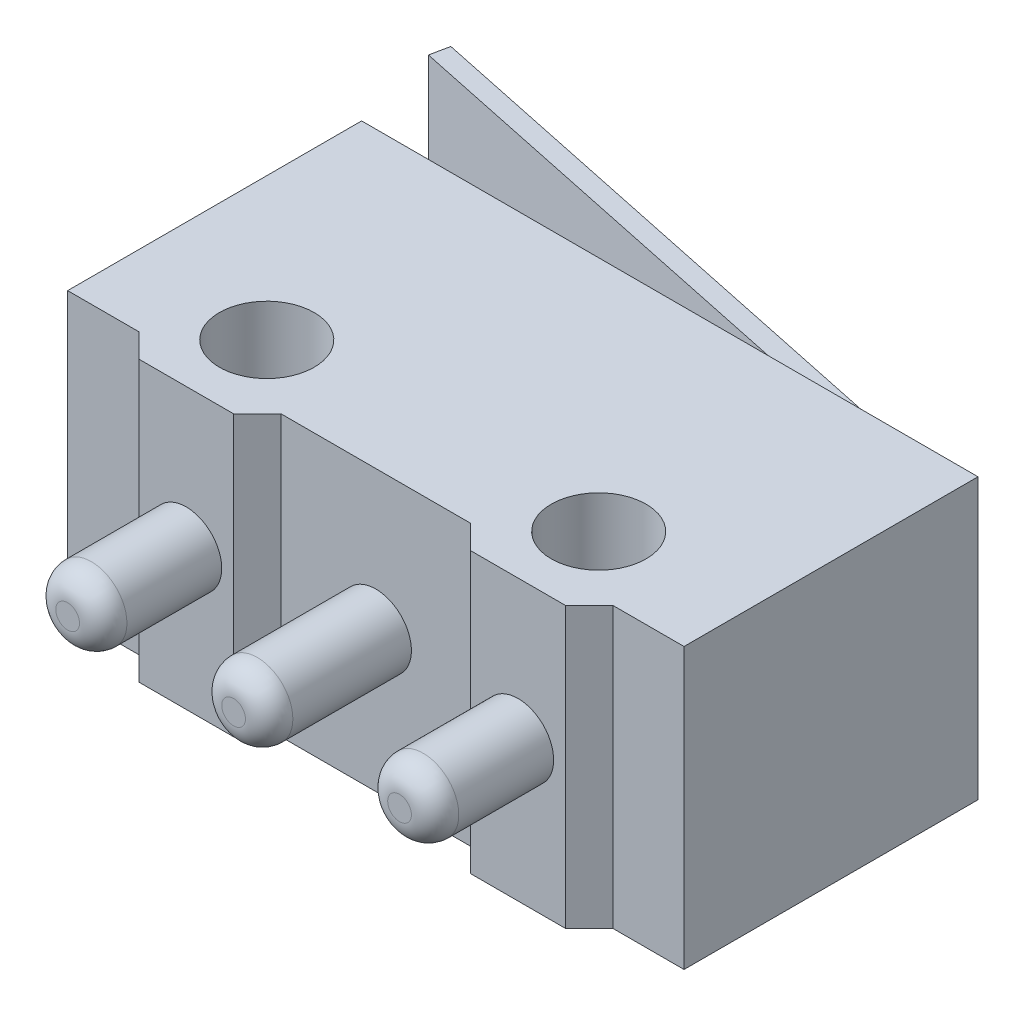
ISO-10303-21;
HEADER;
FILE_DESCRIPTION(('STEP AP214'),'2;1');
FILE_NAME('part.step','',(''),(''),'','','');
FILE_SCHEMA(('AUTOMOTIVE_DESIGN { 1 0 10303 214 1 1 1 1 }'));
ENDSEC;
DATA;
#1=APPLICATION_CONTEXT('core data for automotive mechanical design processes');
#2=APPLICATION_PROTOCOL_DEFINITION('international standard','automotive_design',2000,#1);
#3=PRODUCT_CONTEXT('',#1,'mechanical');
#4=PRODUCT('Part','Part','',(#3));
#5=PRODUCT_RELATED_PRODUCT_CATEGORY('part','',(#4));
#6=PRODUCT_DEFINITION_FORMATION('','',#4);
#7=PRODUCT_DEFINITION_CONTEXT('part definition',#1,'design');
#8=PRODUCT_DEFINITION('design','',#6,#7);
#9=PRODUCT_DEFINITION_SHAPE('','',#8);
#10=(LENGTH_UNIT() NAMED_UNIT(*) SI_UNIT(.MILLI.,.METRE.));
#11=(NAMED_UNIT(*) PLANE_ANGLE_UNIT() SI_UNIT($,.RADIAN.));
#12=(NAMED_UNIT(*) SI_UNIT($,.STERADIAN.) SOLID_ANGLE_UNIT());
#13=UNCERTAINTY_MEASURE_WITH_UNIT(LENGTH_MEASURE(1.E-05),#10,'distance_accuracy_value','');
#14=(GEOMETRIC_REPRESENTATION_CONTEXT(3) GLOBAL_UNCERTAINTY_ASSIGNED_CONTEXT((#13)) GLOBAL_UNIT_ASSIGNED_CONTEXT((#10,
#11,#12)) REPRESENTATION_CONTEXT('',''));
#15=CARTESIAN_POINT('',(0.,0.,0.));
#16=DIRECTION('',(0.,0.,1.));
#17=DIRECTION('',(1.,0.,0.));
#18=AXIS2_PLACEMENT_3D('',#15,#16,#17);
#19=CARTESIAN_POINT('',(5.9,2.95,-3.1));
#20=DIRECTION('',(-0.205748268842548,0.,0.978604950870521));
#21=DIRECTION('',(0.978604950870521,0.,0.205748268842548));
#22=AXIS2_PLACEMENT_3D('',#19,#20,#21);
#23=PLANE('',#22);
#24=DIRECTION('',(-0.978604950870521,0.,-0.205748268842548));
#25=VECTOR('',#24,1.);
#26=CARTESIAN_POINT('',(5.9,-2.45,-3.1));
#27=LINE('',#26,#25);
#28=CARTESIAN_POINT('',(5.9,-2.45,-3.1));
#29=VERTEX_POINT('',#28);
#30=CARTESIAN_POINT('',(-7.41770069246298,-2.45,-5.9));
#31=VERTEX_POINT('',#30);
#32=EDGE_CURVE('E390',#29,#31,#27,.T.);
#33=ORIENTED_EDGE('',*,*,#32,.T.);
#34=DIRECTION('',(0.,-1.,0.));
#35=VECTOR('',#34,1.);
#36=CARTESIAN_POINT('',(-7.41770069246298,2.95,-5.9));
#37=LINE('',#36,#35);
#38=CARTESIAN_POINT('',(-7.41770069246298,2.45,-5.9));
#39=VERTEX_POINT('',#38);
#40=EDGE_CURVE('E221',#39,#31,#37,.T.);
#41=ORIENTED_EDGE('',*,*,#40,.F.);
#42=DIRECTION('',(-0.978604950870521,0.,-0.205748268842548));
#43=VECTOR('',#42,1.);
#44=CARTESIAN_POINT('',(5.9,2.45,-3.1));
#45=LINE('',#44,#43);
#46=CARTESIAN_POINT('',(5.9,2.45,-3.1));
#47=VERTEX_POINT('',#46);
#48=EDGE_CURVE('E398',#47,#39,#45,.T.);
#49=ORIENTED_EDGE('',*,*,#48,.F.);
#50=DIRECTION('',(0.,-1.,0.));
#51=VECTOR('',#50,1.);
#52=CARTESIAN_POINT('',(5.9,2.95,-3.1));
#53=LINE('',#52,#51);
#54=EDGE_CURVE('E224',#47,#29,#53,.T.);
#55=ORIENTED_EDGE('',*,*,#54,.T.);
#56=EDGE_LOOP('',(#33,#41,#49,#55));
#57=FACE_BOUND('',#56,.T.);
#58=ADVANCED_FACE('F32',(#57),#23,.F.);
#59=CARTESIAN_POINT('',(-7.41770069246298,2.95,-5.9));
#60=DIRECTION('',(0.978604950870521,0.,0.205748268842546));
#61=DIRECTION('',(0.205748268842546,0.,-0.978604950870521));
#62=AXIS2_PLACEMENT_3D('',#59,#60,#61);
#63=PLANE('',#62);
#64=DIRECTION('',(-0.205748268842546,0.,0.978604950870521));
#65=VECTOR('',#64,1.);
#66=CARTESIAN_POINT('',(-7.41770069246298,-2.45,-5.9));
#67=LINE('',#66,#65);
#68=CARTESIAN_POINT('',(-7.5,-2.45,-5.50855801965179));
#69=VERTEX_POINT('',#68);
#70=EDGE_CURVE('E384',#31,#69,#67,.T.);
#71=ORIENTED_EDGE('',*,*,#70,.T.);
#72=DIRECTION('',(0.,-1.,0.));
#73=VECTOR('',#72,1.);
#74=CARTESIAN_POINT('',(-7.5,2.95,-5.50855801965179));
#75=LINE('',#74,#73);
#76=CARTESIAN_POINT('',(-7.5,2.45,-5.50855801965179));
#77=VERTEX_POINT('',#76);
#78=EDGE_CURVE('E218',#77,#69,#75,.T.);
#79=ORIENTED_EDGE('',*,*,#78,.F.);
#80=DIRECTION('',(-0.205748268842546,0.,0.978604950870521));
#81=VECTOR('',#80,1.);
#82=CARTESIAN_POINT('',(-7.41770069246298,2.45,-5.9));
#83=LINE('',#82,#81);
#84=EDGE_CURVE('E404',#39,#77,#83,.T.);
#85=ORIENTED_EDGE('',*,*,#84,.F.);
#86=ORIENTED_EDGE('',*,*,#40,.T.);
#87=EDGE_LOOP('',(#71,#79,#85,#86));
#88=FACE_BOUND('',#87,.T.);
#89=ADVANCED_FACE('F262',(#88),#63,.F.);
#90=CARTESIAN_POINT('',(-7.5,2.95,-5.50855801965179));
#91=DIRECTION('',(0.205748268842548,0.,-0.978604950870521));
#92=DIRECTION('',(-0.978604950870521,0.,-0.205748268842548));
#93=AXIS2_PLACEMENT_3D('',#90,#91,#92);
#94=PLANE('',#93);
#95=DIRECTION('',(0.978604950870521,0.,0.205748268842548));
#96=VECTOR('',#95,1.);
#97=CARTESIAN_POINT('',(-7.5,-2.45,-5.50855801965179));
#98=LINE('',#97,#96);
#99=CARTESIAN_POINT('',(3.95587671648355,-2.45,-3.1));
#100=VERTEX_POINT('',#99);
#101=EDGE_CURVE('E374',#69,#100,#98,.T.);
#102=ORIENTED_EDGE('',*,*,#101,.T.);
#103=DIRECTION('',(0.,-1.,0.));
#104=VECTOR('',#103,1.);
#105=CARTESIAN_POINT('',(3.95587671648355,2.95,-3.1));
#106=LINE('',#105,#104);
#107=CARTESIAN_POINT('',(3.95587671648355,2.45,-3.1));
#108=VERTEX_POINT('',#107);
#109=EDGE_CURVE('E216',#108,#100,#106,.T.);
#110=ORIENTED_EDGE('',*,*,#109,.F.);
#111=DIRECTION('',(0.978604950870521,0.,0.205748268842548));
#112=VECTOR('',#111,1.);
#113=CARTESIAN_POINT('',(-7.5,2.45,-5.50855801965179));
#114=LINE('',#113,#112);
#115=EDGE_CURVE('E406',#77,#108,#114,.T.);
#116=ORIENTED_EDGE('',*,*,#115,.F.);
#117=ORIENTED_EDGE('',*,*,#78,.T.);
#118=EDGE_LOOP('',(#102,#110,#116,#117));
#119=FACE_BOUND('',#118,.T.);
#120=ADVANCED_FACE('F268',(#119),#94,.F.);
#121=CARTESIAN_POINT('',(0.,-2.95,0.));
#122=DIRECTION('',(0.,1.,0.));
#123=DIRECTION('',(0.,0.,1.));
#124=AXIS2_PLACEMENT_3D('',#121,#122,#123);
#125=PLANE('',#124);
#126=CARTESIAN_POINT('',(-3.5,-2.95,1.9));
#127=DIRECTION('',(0.,1.,0.));
#128=DIRECTION('',(0.,0.,-1.));
#129=AXIS2_PLACEMENT_3D('',#126,#127,#128);
#130=CIRCLE('',#129,1.);
#131=CARTESIAN_POINT('',(-3.5,-2.95,0.9));
#132=VERTEX_POINT('',#131);
#133=EDGE_CURVE('E412',#132,#132,#130,.T.);
#134=ORIENTED_EDGE('',*,*,#133,.T.);
#135=EDGE_LOOP('',(#134));
#136=FACE_BOUND('',#135,.T.);
#137=CARTESIAN_POINT('',(3.5,-2.95,1.9));
#138=DIRECTION('',(0.,1.,0.));
#139=DIRECTION('',(0.,0.,1.));
#140=AXIS2_PLACEMENT_3D('',#137,#138,#139);
#141=CIRCLE('',#140,1.);
#142=CARTESIAN_POINT('',(3.5,-2.95,2.9));
#143=VERTEX_POINT('',#142);
#144=EDGE_CURVE('E311',#143,#143,#141,.T.);
#145=ORIENTED_EDGE('',*,*,#144,.T.);
#146=EDGE_LOOP('',(#145));
#147=FACE_BOUND('',#146,.T.);
#148=DIRECTION('',(-1.,0.,0.));
#149=VECTOR('',#148,1.);
#150=CARTESIAN_POINT('',(-6.5,-2.95,-3.1));
#151=LINE('',#150,#149);
#152=CARTESIAN_POINT('',(6.5,-2.95,-3.1));
#153=VERTEX_POINT('',#152);
#154=CARTESIAN_POINT('',(-6.5,-2.95,-3.1));
#155=VERTEX_POINT('',#154);
#156=EDGE_CURVE('E101',#153,#155,#151,.T.);
#157=ORIENTED_EDGE('',*,*,#156,.F.);
#158=DIRECTION('',(0.,0.,-1.));
#159=VECTOR('',#158,1.);
#160=CARTESIAN_POINT('',(6.5,-2.95,3.1));
#161=LINE('',#160,#159);
#162=CARTESIAN_POINT('',(6.5,-2.95,3.1));
#163=VERTEX_POINT('',#162);
#164=EDGE_CURVE('E186',#163,#153,#161,.T.);
#165=ORIENTED_EDGE('',*,*,#164,.F.);
#166=DIRECTION('',(1.,0.,0.));
#167=VECTOR('',#166,1.);
#168=CARTESIAN_POINT('',(5.,-2.95,3.1));
#169=LINE('',#168,#167);
#170=CARTESIAN_POINT('',(5.,-2.95,3.1));
#171=VERTEX_POINT('',#170);
#172=EDGE_CURVE('E184',#171,#163,#169,.T.);
#173=ORIENTED_EDGE('',*,*,#172,.F.);
#174=DIRECTION('',(0.707106781186546,0.,-0.707106781186549));
#175=VECTOR('',#174,1.);
#176=CARTESIAN_POINT('',(4.5,-2.95,3.6));
#177=LINE('',#176,#175);
#178=CARTESIAN_POINT('',(4.5,-2.95,3.6));
#179=VERTEX_POINT('',#178);
#180=EDGE_CURVE('E152',#179,#171,#177,.T.);
#181=ORIENTED_EDGE('',*,*,#180,.F.);
#182=DIRECTION('',(1.,0.,0.));
#183=VECTOR('',#182,1.);
#184=CARTESIAN_POINT('',(4.5,-2.95,3.6));
#185=LINE('',#184,#183);
#186=CARTESIAN_POINT('',(2.5,-2.95,3.6));
#187=VERTEX_POINT('',#186);
#188=EDGE_CURVE('E181',#187,#179,#185,.T.);
#189=ORIENTED_EDGE('',*,*,#188,.F.);
#190=DIRECTION('',(0.707106781186547,0.,0.707106781186548));
#191=VECTOR('',#190,1.);
#192=CARTESIAN_POINT('',(2.5,-2.95,3.6));
#193=LINE('',#192,#191);
#194=CARTESIAN_POINT('',(2.,-2.95,3.1));
#195=VERTEX_POINT('',#194);
#196=EDGE_CURVE('E179',#195,#187,#193,.T.);
#197=ORIENTED_EDGE('',*,*,#196,.F.);
#198=DIRECTION('',(1.,0.,0.));
#199=VECTOR('',#198,1.);
#200=CARTESIAN_POINT('',(-2.,-2.95,3.1));
#201=LINE('',#200,#199);
#202=CARTESIAN_POINT('',(-2.,-2.95,3.1));
#203=VERTEX_POINT('',#202);
#204=EDGE_CURVE('E177',#203,#195,#201,.T.);
#205=ORIENTED_EDGE('',*,*,#204,.F.);
#206=DIRECTION('',(0.707106781186547,0.,-0.707106781186548));
#207=VECTOR('',#206,1.);
#208=CARTESIAN_POINT('',(-2.5,-2.95,3.6));
#209=LINE('',#208,#207);
#210=CARTESIAN_POINT('',(-2.5,-2.95,3.6));
#211=VERTEX_POINT('',#210);
#212=EDGE_CURVE('E175',#211,#203,#209,.T.);
#213=ORIENTED_EDGE('',*,*,#212,.F.);
#214=DIRECTION('',(1.,0.,0.));
#215=VECTOR('',#214,1.);
#216=CARTESIAN_POINT('',(-4.5,-2.95,3.6));
#217=LINE('',#216,#215);
#218=CARTESIAN_POINT('',(-4.5,-2.95,3.6));
#219=VERTEX_POINT('',#218);
#220=EDGE_CURVE('E173',#219,#211,#217,.T.);
#221=ORIENTED_EDGE('',*,*,#220,.F.);
#222=DIRECTION('',(0.707106781186546,0.,0.707106781186549));
#223=VECTOR('',#222,1.);
#224=CARTESIAN_POINT('',(-4.5,-2.95,3.6));
#225=LINE('',#224,#223);
#226=CARTESIAN_POINT('',(-5.,-2.95,3.1));
#227=VERTEX_POINT('',#226);
#228=EDGE_CURVE('E171',#227,#219,#225,.T.);
#229=ORIENTED_EDGE('',*,*,#228,.F.);
#230=DIRECTION('',(1.,0.,0.));
#231=VECTOR('',#230,1.);
#232=CARTESIAN_POINT('',(-6.5,-2.95,3.1));
#233=LINE('',#232,#231);
#234=CARTESIAN_POINT('',(-6.5,-2.95,3.1));
#235=VERTEX_POINT('',#234);
#236=EDGE_CURVE('E169',#235,#227,#233,.T.);
#237=ORIENTED_EDGE('',*,*,#236,.F.);
#238=DIRECTION('',(0.,0.,1.));
#239=VECTOR('',#238,1.);
#240=CARTESIAN_POINT('',(-6.5,-2.95,3.1));
#241=LINE('',#240,#239);
#242=EDGE_CURVE('E166',#155,#235,#241,.T.);
#243=ORIENTED_EDGE('',*,*,#242,.F.);
#244=EDGE_LOOP('',(#157,#165,#173,#181,#189,#197,#205,#213,#221,#229,#237,#243));
#245=FACE_BOUND('',#244,.T.);
#246=ADVANCED_FACE('F300',(#136,#147,#245),#125,.F.);
#247=CARTESIAN_POINT('',(0.,2.95,0.));
#248=DIRECTION('',(0.,1.,0.));
#249=DIRECTION('',(0.,0.,1.));
#250=AXIS2_PLACEMENT_3D('',#247,#248,#249);
#251=PLANE('',#250);
#252=DIRECTION('',(-1.,0.,0.));
#253=VECTOR('',#252,1.);
#254=CARTESIAN_POINT('',(5.9,2.95,-3.1));
#255=LINE('',#254,#253);
#256=CARTESIAN_POINT('',(6.5,2.95,-3.1));
#257=VERTEX_POINT('',#256);
#258=CARTESIAN_POINT('',(-6.5,2.95,-3.1));
#259=VERTEX_POINT('',#258);
#260=EDGE_CURVE('E107',#257,#259,#255,.T.);
#261=ORIENTED_EDGE('',*,*,#260,.T.);
#262=DIRECTION('',(0.,0.,1.));
#263=VECTOR('',#262,1.);
#264=CARTESIAN_POINT('',(-6.5,2.95,3.1));
#265=LINE('',#264,#263);
#266=CARTESIAN_POINT('',(-6.5,2.95,3.1));
#267=VERTEX_POINT('',#266);
#268=EDGE_CURVE('E306',#259,#267,#265,.T.);
#269=ORIENTED_EDGE('',*,*,#268,.T.);
#270=DIRECTION('',(1.,0.,0.));
#271=VECTOR('',#270,1.);
#272=CARTESIAN_POINT('',(-6.5,2.95,3.1));
#273=LINE('',#272,#271);
#274=CARTESIAN_POINT('',(-5.,2.95,3.1));
#275=VERTEX_POINT('',#274);
#276=EDGE_CURVE('E308',#267,#275,#273,.T.);
#277=ORIENTED_EDGE('',*,*,#276,.T.);
#278=DIRECTION('',(0.707106781186546,0.,0.707106781186549));
#279=VECTOR('',#278,1.);
#280=CARTESIAN_POINT('',(-4.5,2.95,3.6));
#281=LINE('',#280,#279);
#282=CARTESIAN_POINT('',(-4.5,2.95,3.6));
#283=VERTEX_POINT('',#282);
#284=EDGE_CURVE('E315',#275,#283,#281,.T.);
#285=ORIENTED_EDGE('',*,*,#284,.T.);
#286=DIRECTION('',(1.,0.,0.));
#287=VECTOR('',#286,1.);
#288=CARTESIAN_POINT('',(-4.5,2.95,3.6));
#289=LINE('',#288,#287);
#290=CARTESIAN_POINT('',(-2.5,2.95,3.6));
#291=VERTEX_POINT('',#290);
#292=EDGE_CURVE('E317',#283,#291,#289,.T.);
#293=ORIENTED_EDGE('',*,*,#292,.T.);
#294=DIRECTION('',(0.707106781186547,0.,-0.707106781186548));
#295=VECTOR('',#294,1.);
#296=CARTESIAN_POINT('',(-2.5,2.95,3.6));
#297=LINE('',#296,#295);
#298=CARTESIAN_POINT('',(-2.,2.95,3.1));
#299=VERTEX_POINT('',#298);
#300=EDGE_CURVE('E319',#291,#299,#297,.T.);
#301=ORIENTED_EDGE('',*,*,#300,.T.);
#302=DIRECTION('',(1.,0.,0.));
#303=VECTOR('',#302,1.);
#304=CARTESIAN_POINT('',(-2.,2.95,3.1));
#305=LINE('',#304,#303);
#306=CARTESIAN_POINT('',(2.,2.95,3.1));
#307=VERTEX_POINT('',#306);
#308=EDGE_CURVE('E321',#299,#307,#305,.T.);
#309=ORIENTED_EDGE('',*,*,#308,.T.);
#310=DIRECTION('',(0.707106781186547,0.,0.707106781186548));
#311=VECTOR('',#310,1.);
#312=CARTESIAN_POINT('',(2.5,2.95,3.6));
#313=LINE('',#312,#311);
#314=CARTESIAN_POINT('',(2.5,2.95,3.6));
#315=VERTEX_POINT('',#314);
#316=EDGE_CURVE('E323',#307,#315,#313,.T.);
#317=ORIENTED_EDGE('',*,*,#316,.T.);
#318=DIRECTION('',(1.,0.,0.));
#319=VECTOR('',#318,1.);
#320=CARTESIAN_POINT('',(4.5,2.95,3.6));
#321=LINE('',#320,#319);
#322=CARTESIAN_POINT('',(4.5,2.95,3.6));
#323=VERTEX_POINT('',#322);
#324=EDGE_CURVE('E143',#315,#323,#321,.T.);
#325=ORIENTED_EDGE('',*,*,#324,.T.);
#326=DIRECTION('',(0.707106781186546,0.,-0.707106781186549));
#327=VECTOR('',#326,1.);
#328=CARTESIAN_POINT('',(4.5,2.95,3.6));
#329=LINE('',#328,#327);
#330=CARTESIAN_POINT('',(5.,2.95,3.1));
#331=VERTEX_POINT('',#330);
#332=EDGE_CURVE('E135',#323,#331,#329,.T.);
#333=ORIENTED_EDGE('',*,*,#332,.T.);
#334=DIRECTION('',(1.,0.,0.));
#335=VECTOR('',#334,1.);
#336=CARTESIAN_POINT('',(5.,2.95,3.1));
#337=LINE('',#336,#335);
#338=CARTESIAN_POINT('',(6.5,2.95,3.1));
#339=VERTEX_POINT('',#338);
#340=EDGE_CURVE('E140',#331,#339,#337,.T.);
#341=ORIENTED_EDGE('',*,*,#340,.T.);
#342=DIRECTION('',(0.,0.,-1.));
#343=VECTOR('',#342,1.);
#344=CARTESIAN_POINT('',(6.5,2.95,3.1));
#345=LINE('',#344,#343);
#346=EDGE_CURVE('E56',#339,#257,#345,.T.);
#347=ORIENTED_EDGE('',*,*,#346,.T.);
#348=EDGE_LOOP('',(#261,#269,#277,#285,#293,#301,#309,#317,#325,#333,#341,#347));
#349=FACE_BOUND('',#348,.T.);
#350=CARTESIAN_POINT('',(3.5,2.95,1.9));
#351=DIRECTION('',(0.,1.,0.));
#352=DIRECTION('',(0.,0.,1.));
#353=AXIS2_PLACEMENT_3D('',#350,#351,#352);
#354=CIRCLE('',#353,1.);
#355=CARTESIAN_POINT('',(3.5,2.95,2.9));
#356=VERTEX_POINT('',#355);
#357=EDGE_CURVE('E167',#356,#356,#354,.T.);
#358=ORIENTED_EDGE('',*,*,#357,.F.);
#359=EDGE_LOOP('',(#358));
#360=FACE_BOUND('',#359,.T.);
#361=CARTESIAN_POINT('',(-3.5,2.95,1.9));
#362=DIRECTION('',(0.,1.,0.));
#363=DIRECTION('',(0.,0.,-1.));
#364=AXIS2_PLACEMENT_3D('',#361,#362,#363);
#365=CIRCLE('',#364,1.);
#366=CARTESIAN_POINT('',(-3.5,2.95,0.9));
#367=VERTEX_POINT('',#366);
#368=EDGE_CURVE('E413',#367,#367,#365,.T.);
#369=ORIENTED_EDGE('',*,*,#368,.F.);
#370=EDGE_LOOP('',(#369));
#371=FACE_BOUND('',#370,.T.);
#372=ADVANCED_FACE('F137',(#349,#360,#371),#251,.T.);
#373=CARTESIAN_POINT('',(-6.5,2.95,-3.1));
#374=DIRECTION('',(0.,0.,1.));
#375=DIRECTION('',(1.,0.,0.));
#376=AXIS2_PLACEMENT_3D('',#373,#374,#375);
#377=PLANE('',#376);
#378=DIRECTION('',(0.,-1.,0.));
#379=VECTOR('',#378,1.);
#380=CARTESIAN_POINT('',(6.5,2.95,-3.1));
#381=LINE('',#380,#379);
#382=EDGE_CURVE('E161',#257,#153,#381,.T.);
#383=ORIENTED_EDGE('',*,*,#382,.T.);
#384=ORIENTED_EDGE('',*,*,#156,.T.);
#385=DIRECTION('',(0.,-1.,0.));
#386=VECTOR('',#385,1.);
#387=CARTESIAN_POINT('',(-6.5,2.95,-3.1));
#388=LINE('',#387,#386);
#389=EDGE_CURVE('E213',#259,#155,#388,.T.);
#390=ORIENTED_EDGE('',*,*,#389,.F.);
#391=ORIENTED_EDGE('',*,*,#260,.F.);
#392=EDGE_LOOP('',(#383,#384,#390,#391));
#393=FACE_BOUND('',#392,.T.);
#394=DIRECTION('',(1.,0.,0.));
#395=VECTOR('',#394,1.);
#396=CARTESIAN_POINT('',(5.9,-2.45,-3.1));
#397=LINE('',#396,#395);
#398=EDGE_CURVE('E385',#100,#29,#397,.T.);
#399=ORIENTED_EDGE('',*,*,#398,.T.);
#400=ORIENTED_EDGE('',*,*,#54,.F.);
#401=DIRECTION('',(1.,0.,0.));
#402=VECTOR('',#401,1.);
#403=CARTESIAN_POINT('',(5.9,2.45,-3.1));
#404=LINE('',#403,#402);
#405=EDGE_CURVE('E47',#108,#47,#404,.T.);
#406=ORIENTED_EDGE('',*,*,#405,.F.);
#407=ORIENTED_EDGE('',*,*,#109,.T.);
#408=EDGE_LOOP('',(#399,#400,#406,#407));
#409=FACE_BOUND('',#408,.T.);
#410=ADVANCED_FACE('F304',(#393,#409),#377,.F.);
#411=CARTESIAN_POINT('',(-6.5,2.95,3.1));
#412=DIRECTION('',(1.,0.,0.));
#413=DIRECTION('',(0.,0.,-1.));
#414=AXIS2_PLACEMENT_3D('',#411,#412,#413);
#415=PLANE('',#414);
#416=ORIENTED_EDGE('',*,*,#242,.T.);
#417=DIRECTION('',(0.,-1.,0.));
#418=VECTOR('',#417,1.);
#419=CARTESIAN_POINT('',(-6.5,2.95,3.1));
#420=LINE('',#419,#418);
#421=EDGE_CURVE('E210',#267,#235,#420,.T.);
#422=ORIENTED_EDGE('',*,*,#421,.F.);
#423=ORIENTED_EDGE('',*,*,#268,.F.);
#424=ORIENTED_EDGE('',*,*,#389,.T.);
#425=EDGE_LOOP('',(#416,#422,#423,#424));
#426=FACE_BOUND('',#425,.T.);
#427=ADVANCED_FACE('F353',(#426),#415,.F.);
#428=CARTESIAN_POINT('',(-6.5,2.95,3.1));
#429=DIRECTION('',(0.,0.,-1.));
#430=DIRECTION('',(-1.,0.,0.));
#431=AXIS2_PLACEMENT_3D('',#428,#429,#430);
#432=PLANE('',#431);
#433=ORIENTED_EDGE('',*,*,#236,.T.);
#434=DIRECTION('',(0.,-1.,0.));
#435=VECTOR('',#434,1.);
#436=CARTESIAN_POINT('',(-5.,2.95,3.1));
#437=LINE('',#436,#435);
#438=EDGE_CURVE('E207',#275,#227,#437,.T.);
#439=ORIENTED_EDGE('',*,*,#438,.F.);
#440=ORIENTED_EDGE('',*,*,#276,.F.);
#441=ORIENTED_EDGE('',*,*,#421,.T.);
#442=EDGE_LOOP('',(#433,#439,#440,#441));
#443=FACE_BOUND('',#442,.T.);
#444=ADVANCED_FACE('F350',(#443),#432,.F.);
#445=CARTESIAN_POINT('',(-4.5,2.95,3.6));
#446=DIRECTION('',(0.707106781186549,0.,-0.707106781186546));
#447=DIRECTION('',(-0.707106781186546,0.,-0.707106781186549));
#448=AXIS2_PLACEMENT_3D('',#445,#446,#447);
#449=PLANE('',#448);
#450=ORIENTED_EDGE('',*,*,#228,.T.);
#451=DIRECTION('',(0.,-1.,0.));
#452=VECTOR('',#451,1.);
#453=CARTESIAN_POINT('',(-4.5,2.95,3.6));
#454=LINE('',#453,#452);
#455=EDGE_CURVE('E204',#283,#219,#454,.T.);
#456=ORIENTED_EDGE('',*,*,#455,.F.);
#457=ORIENTED_EDGE('',*,*,#284,.F.);
#458=ORIENTED_EDGE('',*,*,#438,.T.);
#459=EDGE_LOOP('',(#450,#456,#457,#458));
#460=FACE_BOUND('',#459,.T.);
#461=ADVANCED_FACE('F345',(#460),#449,.F.);
#462=CARTESIAN_POINT('',(-4.5,2.95,3.6));
#463=DIRECTION('',(0.,0.,-1.));
#464=DIRECTION('',(-1.,0.,0.));
#465=AXIS2_PLACEMENT_3D('',#462,#463,#464);
#466=PLANE('',#465);
#467=CARTESIAN_POINT('',(-3.5,0.,3.6));
#468=DIRECTION('',(0.,0.,-1.));
#469=DIRECTION('',(-1.,0.,0.));
#470=AXIS2_PLACEMENT_3D('',#467,#468,#469);
#471=CIRCLE('',#470,0.75);
#472=CARTESIAN_POINT('',(-4.25,0.,3.6));
#473=VERTEX_POINT('',#472);
#474=EDGE_CURVE('E230',#473,#473,#471,.F.);
#475=ORIENTED_EDGE('',*,*,#474,.F.);
#476=EDGE_LOOP('',(#475));
#477=FACE_BOUND('',#476,.T.);
#478=ORIENTED_EDGE('',*,*,#220,.T.);
#479=DIRECTION('',(0.,-1.,0.));
#480=VECTOR('',#479,1.);
#481=CARTESIAN_POINT('',(-2.5,2.95,3.6));
#482=LINE('',#481,#480);
#483=EDGE_CURVE('E201',#291,#211,#482,.T.);
#484=ORIENTED_EDGE('',*,*,#483,.F.);
#485=ORIENTED_EDGE('',*,*,#292,.F.);
#486=ORIENTED_EDGE('',*,*,#455,.T.);
#487=EDGE_LOOP('',(#478,#484,#485,#486));
#488=FACE_BOUND('',#487,.T.);
#489=ADVANCED_FACE('F340',(#477,#488),#466,.F.);
#490=CARTESIAN_POINT('',(-2.5,2.95,3.6));
#491=DIRECTION('',(-0.707106781186548,0.,-0.707106781186547));
#492=DIRECTION('',(-0.707106781186547,0.,0.707106781186548));
#493=AXIS2_PLACEMENT_3D('',#490,#491,#492);
#494=PLANE('',#493);
#495=ORIENTED_EDGE('',*,*,#212,.T.);
#496=DIRECTION('',(0.,-1.,0.));
#497=VECTOR('',#496,1.);
#498=CARTESIAN_POINT('',(-2.,2.95,3.1));
#499=LINE('',#498,#497);
#500=EDGE_CURVE('E198',#299,#203,#499,.T.);
#501=ORIENTED_EDGE('',*,*,#500,.F.);
#502=ORIENTED_EDGE('',*,*,#300,.F.);
#503=ORIENTED_EDGE('',*,*,#483,.T.);
#504=EDGE_LOOP('',(#495,#501,#502,#503));
#505=FACE_BOUND('',#504,.T.);
#506=ADVANCED_FACE('F336',(#505),#494,.F.);
#507=CARTESIAN_POINT('',(-2.,2.95,3.1));
#508=DIRECTION('',(0.,0.,-1.));
#509=DIRECTION('',(-1.,0.,0.));
#510=AXIS2_PLACEMENT_3D('',#507,#508,#509);
#511=PLANE('',#510);
#512=CARTESIAN_POINT('',(0.,0.,3.1));
#513=DIRECTION('',(0.,0.,-1.));
#514=DIRECTION('',(-1.,0.,0.));
#515=AXIS2_PLACEMENT_3D('',#512,#513,#514);
#516=CIRCLE('',#515,0.75);
#517=CARTESIAN_POINT('',(-0.75,0.,3.1));
#518=VERTEX_POINT('',#517);
#519=EDGE_CURVE('E227',#518,#518,#516,.F.);
#520=ORIENTED_EDGE('',*,*,#519,.F.);
#521=EDGE_LOOP('',(#520));
#522=FACE_BOUND('',#521,.T.);
#523=ORIENTED_EDGE('',*,*,#204,.T.);
#524=DIRECTION('',(0.,-1.,0.));
#525=VECTOR('',#524,1.);
#526=CARTESIAN_POINT('',(2.,2.95,3.1));
#527=LINE('',#526,#525);
#528=EDGE_CURVE('E195',#307,#195,#527,.T.);
#529=ORIENTED_EDGE('',*,*,#528,.F.);
#530=ORIENTED_EDGE('',*,*,#308,.F.);
#531=ORIENTED_EDGE('',*,*,#500,.T.);
#532=EDGE_LOOP('',(#523,#529,#530,#531));
#533=FACE_BOUND('',#532,.T.);
#534=ADVANCED_FACE('F332',(#522,#533),#511,.F.);
#535=CARTESIAN_POINT('',(2.5,2.95,3.6));
#536=DIRECTION('',(0.707106781186548,0.,-0.707106781186547));
#537=DIRECTION('',(-0.707106781186547,0.,-0.707106781186548));
#538=AXIS2_PLACEMENT_3D('',#535,#536,#537);
#539=PLANE('',#538);
#540=ORIENTED_EDGE('',*,*,#196,.T.);
#541=DIRECTION('',(0.,-1.,0.));
#542=VECTOR('',#541,1.);
#543=CARTESIAN_POINT('',(2.5,2.95,3.6));
#544=LINE('',#543,#542);
#545=EDGE_CURVE('E192',#315,#187,#544,.T.);
#546=ORIENTED_EDGE('',*,*,#545,.F.);
#547=ORIENTED_EDGE('',*,*,#316,.F.);
#548=ORIENTED_EDGE('',*,*,#528,.T.);
#549=EDGE_LOOP('',(#540,#546,#547,#548));
#550=FACE_BOUND('',#549,.T.);
#551=ADVANCED_FACE('F295',(#550),#539,.F.);
#552=CARTESIAN_POINT('',(4.5,2.95,3.6));
#553=DIRECTION('',(0.,0.,-1.));
#554=DIRECTION('',(-1.,0.,0.));
#555=AXIS2_PLACEMENT_3D('',#552,#553,#554);
#556=PLANE('',#555);
#557=CARTESIAN_POINT('',(3.5,0.,3.6));
#558=DIRECTION('',(0.,0.,-1.));
#559=DIRECTION('',(-1.,0.,0.));
#560=AXIS2_PLACEMENT_3D('',#557,#558,#559);
#561=CIRCLE('',#560,0.750000000000001);
#562=CARTESIAN_POINT('',(2.75,0.,3.6));
#563=VERTEX_POINT('',#562);
#564=EDGE_CURVE('E233',#563,#563,#561,.F.);
#565=ORIENTED_EDGE('',*,*,#564,.F.);
#566=EDGE_LOOP('',(#565));
#567=FACE_BOUND('',#566,.T.);
#568=ORIENTED_EDGE('',*,*,#188,.T.);
#569=DIRECTION('',(0.,-1.,0.));
#570=VECTOR('',#569,1.);
#571=CARTESIAN_POINT('',(4.5,2.95,3.6));
#572=LINE('',#571,#570);
#573=EDGE_CURVE('E155',#323,#179,#572,.T.);
#574=ORIENTED_EDGE('',*,*,#573,.F.);
#575=ORIENTED_EDGE('',*,*,#324,.F.);
#576=ORIENTED_EDGE('',*,*,#545,.T.);
#577=EDGE_LOOP('',(#568,#574,#575,#576));
#578=FACE_BOUND('',#577,.T.);
#579=ADVANCED_FACE('F292',(#567,#578),#556,.F.);
#580=CARTESIAN_POINT('',(4.5,2.95,3.6));
#581=DIRECTION('',(-0.707106781186549,0.,-0.707106781186546));
#582=DIRECTION('',(-0.707106781186546,0.,0.707106781186549));
#583=AXIS2_PLACEMENT_3D('',#580,#581,#582);
#584=PLANE('',#583);
#585=ORIENTED_EDGE('',*,*,#180,.T.);
#586=DIRECTION('',(0.,-1.,0.));
#587=VECTOR('',#586,1.);
#588=CARTESIAN_POINT('',(5.,2.95,3.1));
#589=LINE('',#588,#587);
#590=EDGE_CURVE('E149',#331,#171,#589,.T.);
#591=ORIENTED_EDGE('',*,*,#590,.F.);
#592=ORIENTED_EDGE('',*,*,#332,.F.);
#593=ORIENTED_EDGE('',*,*,#573,.T.);
#594=EDGE_LOOP('',(#585,#591,#592,#593));
#595=FACE_BOUND('',#594,.T.);
#596=ADVANCED_FACE('F150',(#595),#584,.F.);
#597=CARTESIAN_POINT('',(5.,2.95,3.1));
#598=DIRECTION('',(0.,0.,-1.));
#599=DIRECTION('',(-1.,0.,0.));
#600=AXIS2_PLACEMENT_3D('',#597,#598,#599);
#601=PLANE('',#600);
#602=ORIENTED_EDGE('',*,*,#172,.T.);
#603=DIRECTION('',(0.,-1.,0.));
#604=VECTOR('',#603,1.);
#605=CARTESIAN_POINT('',(6.5,2.95,3.1));
#606=LINE('',#605,#604);
#607=EDGE_CURVE('E156',#339,#163,#606,.T.);
#608=ORIENTED_EDGE('',*,*,#607,.F.);
#609=ORIENTED_EDGE('',*,*,#340,.F.);
#610=ORIENTED_EDGE('',*,*,#590,.T.);
#611=EDGE_LOOP('',(#602,#608,#609,#610));
#612=FACE_BOUND('',#611,.T.);
#613=ADVANCED_FACE('F158',(#612),#601,.F.);
#614=CARTESIAN_POINT('',(6.5,2.95,3.1));
#615=DIRECTION('',(-1.,0.,0.));
#616=DIRECTION('',(0.,0.,1.));
#617=AXIS2_PLACEMENT_3D('',#614,#615,#616);
#618=PLANE('',#617);
#619=ORIENTED_EDGE('',*,*,#164,.T.);
#620=ORIENTED_EDGE('',*,*,#382,.F.);
#621=ORIENTED_EDGE('',*,*,#346,.F.);
#622=ORIENTED_EDGE('',*,*,#607,.T.);
#623=EDGE_LOOP('',(#619,#620,#621,#622));
#624=FACE_BOUND('',#623,.T.);
#625=ADVANCED_FACE('F302',(#624),#618,.F.);
#626=CARTESIAN_POINT('',(3.5,2.95,1.9));
#627=DIRECTION('',(0.,-1.,0.));
#628=DIRECTION('',(0.,0.,-1.));
#629=AXIS2_PLACEMENT_3D('',#626,#627,#628);
#630=CYLINDRICAL_SURFACE('',#629,1.);
#631=ORIENTED_EDGE('',*,*,#357,.T.);
#632=EDGE_LOOP('',(#631));
#633=FACE_BOUND('',#632,.T.);
#634=ORIENTED_EDGE('',*,*,#144,.F.);
#635=EDGE_LOOP('',(#634));
#636=FACE_BOUND('',#635,.T.);
#637=ADVANCED_FACE('F424',(#633,#636),#630,.F.);
#638=CARTESIAN_POINT('',(-3.5,2.95,1.9));
#639=DIRECTION('',(0.,-1.,0.));
#640=DIRECTION('',(0.,0.,-1.));
#641=AXIS2_PLACEMENT_3D('',#638,#639,#640);
#642=CYLINDRICAL_SURFACE('',#641,1.);
#643=ORIENTED_EDGE('',*,*,#368,.T.);
#644=EDGE_LOOP('',(#643));
#645=FACE_BOUND('',#644,.T.);
#646=ORIENTED_EDGE('',*,*,#133,.F.);
#647=EDGE_LOOP('',(#646));
#648=FACE_BOUND('',#647,.T.);
#649=ADVANCED_FACE('F426',(#645,#648),#642,.F.);
#650=CARTESIAN_POINT('',(0.,2.45,0.));
#651=DIRECTION('',(0.,1.,0.));
#652=DIRECTION('',(0.,0.,1.));
#653=AXIS2_PLACEMENT_3D('',#650,#651,#652);
#654=PLANE('',#653);
#655=ORIENTED_EDGE('',*,*,#48,.T.);
#656=ORIENTED_EDGE('',*,*,#84,.T.);
#657=ORIENTED_EDGE('',*,*,#115,.T.);
#658=ORIENTED_EDGE('',*,*,#405,.T.);
#659=EDGE_LOOP('',(#655,#656,#657,#658));
#660=FACE_BOUND('',#659,.T.);
#661=ADVANCED_FACE('F432',(#660),#654,.T.);
#662=CARTESIAN_POINT('',(0.,-2.45,0.));
#663=DIRECTION('',(0.,-1.,0.));
#664=DIRECTION('',(0.,0.,1.));
#665=AXIS2_PLACEMENT_3D('',#662,#663,#664);
#666=PLANE('',#665);
#667=ORIENTED_EDGE('',*,*,#32,.F.);
#668=ORIENTED_EDGE('',*,*,#398,.F.);
#669=ORIENTED_EDGE('',*,*,#101,.F.);
#670=ORIENTED_EDGE('',*,*,#70,.F.);
#671=EDGE_LOOP('',(#667,#668,#669,#670));
#672=FACE_BOUND('',#671,.T.);
#673=ADVANCED_FACE('F392',(#672),#666,.T.);
#674=CARTESIAN_POINT('',(0.,0.,6.1));
#675=DIRECTION('',(0.,0.,-1.));
#676=DIRECTION('',(-1.,0.,0.));
#677=AXIS2_PLACEMENT_3D('',#674,#675,#676);
#678=CYLINDRICAL_SURFACE('',#677,0.75);
#679=CARTESIAN_POINT('',(0.,0.,5.6));
#680=DIRECTION('',(0.,0.,1.));
#681=DIRECTION('',(1.,0.,0.));
#682=AXIS2_PLACEMENT_3D('',#679,#680,#681);
#683=CIRCLE('',#682,0.75);
#684=CARTESIAN_POINT('',(0.75,0.,5.6));
#685=VERTEX_POINT('',#684);
#686=EDGE_CURVE('E245',#685,#685,#683,.F.);
#687=ORIENTED_EDGE('',*,*,#686,.T.);
#688=EDGE_LOOP('',(#687));
#689=FACE_BOUND('',#688,.T.);
#690=ORIENTED_EDGE('',*,*,#519,.T.);
#691=EDGE_LOOP('',(#690));
#692=FACE_BOUND('',#691,.T.);
#693=ADVANCED_FACE('F551',(#689,#692),#678,.T.);
#694=CARTESIAN_POINT('',(0.,0.,6.1));
#695=DIRECTION('',(0.,0.,1.));
#696=DIRECTION('',(1.,0.,0.));
#697=AXIS2_PLACEMENT_3D('',#694,#695,#696);
#698=PLANE('',#697);
#699=CARTESIAN_POINT('',(0.,0.,6.1));
#700=DIRECTION('',(0.,0.,1.));
#701=DIRECTION('',(1.,0.,0.));
#702=AXIS2_PLACEMENT_3D('',#699,#700,#701);
#703=CIRCLE('',#702,0.25);
#704=CARTESIAN_POINT('',(0.25,0.,6.1));
#705=VERTEX_POINT('',#704);
#706=EDGE_CURVE('E242',#705,#705,#703,.T.);
#707=ORIENTED_EDGE('',*,*,#706,.T.);
#708=EDGE_LOOP('',(#707));
#709=FACE_BOUND('',#708,.T.);
#710=ADVANCED_FACE('F560',(#709),#698,.T.);
#711=CARTESIAN_POINT('',(-3.5,0.,6.1));
#712=DIRECTION('',(0.,0.,-1.));
#713=DIRECTION('',(-1.,0.,0.));
#714=AXIS2_PLACEMENT_3D('',#711,#712,#713);
#715=CYLINDRICAL_SURFACE('',#714,0.75);
#716=CARTESIAN_POINT('',(-3.5,0.,5.6));
#717=DIRECTION('',(0.,0.,1.));
#718=DIRECTION('',(1.,0.,0.));
#719=AXIS2_PLACEMENT_3D('',#716,#717,#718);
#720=CIRCLE('',#719,0.75);
#721=CARTESIAN_POINT('',(-2.75,0.,5.6));
#722=VERTEX_POINT('',#721);
#723=EDGE_CURVE('E11',#722,#722,#720,.F.);
#724=ORIENTED_EDGE('',*,*,#723,.T.);
#725=EDGE_LOOP('',(#724));
#726=FACE_BOUND('',#725,.T.);
#727=ORIENTED_EDGE('',*,*,#474,.T.);
#728=EDGE_LOOP('',(#727));
#729=FACE_BOUND('',#728,.T.);
#730=ADVANCED_FACE('F567',(#726,#729),#715,.T.);
#731=CARTESIAN_POINT('',(-3.5,0.,6.1));
#732=DIRECTION('',(0.,0.,1.));
#733=DIRECTION('',(1.,0.,0.));
#734=AXIS2_PLACEMENT_3D('',#731,#732,#733);
#735=PLANE('',#734);
#736=CARTESIAN_POINT('',(-3.5,0.,6.1));
#737=DIRECTION('',(0.,0.,1.));
#738=DIRECTION('',(1.,0.,0.));
#739=AXIS2_PLACEMENT_3D('',#736,#737,#738);
#740=CIRCLE('',#739,0.25);
#741=CARTESIAN_POINT('',(-3.25,0.,6.1));
#742=VERTEX_POINT('',#741);
#743=EDGE_CURVE('E40',#742,#742,#740,.T.);
#744=ORIENTED_EDGE('',*,*,#743,.T.);
#745=EDGE_LOOP('',(#744));
#746=FACE_BOUND('',#745,.T.);
#747=ADVANCED_FACE('F250',(#746),#735,.T.);
#748=CARTESIAN_POINT('',(3.5,0.,6.1));
#749=DIRECTION('',(0.,0.,-1.));
#750=DIRECTION('',(-1.,0.,0.));
#751=AXIS2_PLACEMENT_3D('',#748,#749,#750);
#752=CYLINDRICAL_SURFACE('',#751,0.750000000000001);
#753=CARTESIAN_POINT('',(3.5,0.,5.6));
#754=DIRECTION('',(0.,0.,-1.));
#755=DIRECTION('',(-1.,0.,0.));
#756=AXIS2_PLACEMENT_3D('',#753,#754,#755);
#757=CIRCLE('',#756,0.750000000000001);
#758=CARTESIAN_POINT('',(2.75,0.,5.6));
#759=VERTEX_POINT('',#758);
#760=EDGE_CURVE('E239',#759,#759,#757,.T.);
#761=ORIENTED_EDGE('',*,*,#760,.T.);
#762=EDGE_LOOP('',(#761));
#763=FACE_BOUND('',#762,.T.);
#764=ORIENTED_EDGE('',*,*,#564,.T.);
#765=EDGE_LOOP('',(#764));
#766=FACE_BOUND('',#765,.T.);
#767=ADVANCED_FACE('F280',(#763,#766),#752,.T.);
#768=CARTESIAN_POINT('',(3.5,0.,6.1));
#769=DIRECTION('',(0.,0.,-1.));
#770=DIRECTION('',(-1.,0.,0.));
#771=AXIS2_PLACEMENT_3D('',#768,#769,#770);
#772=PLANE('',#771);
#773=CARTESIAN_POINT('',(3.5,0.,6.1));
#774=DIRECTION('',(0.,0.,-1.));
#775=DIRECTION('',(-1.,0.,0.));
#776=AXIS2_PLACEMENT_3D('',#773,#774,#775);
#777=CIRCLE('',#776,0.250000000000001);
#778=CARTESIAN_POINT('',(3.25,0.,6.1));
#779=VERTEX_POINT('',#778);
#780=EDGE_CURVE('E236',#779,#779,#777,.F.);
#781=ORIENTED_EDGE('',*,*,#780,.T.);
#782=EDGE_LOOP('',(#781));
#783=FACE_BOUND('',#782,.T.);
#784=ADVANCED_FACE('F275',(#783),#772,.F.);
#785=CARTESIAN_POINT('',(3.5,0.,5.6));
#786=DIRECTION('',(0.,0.,-1.));
#787=DIRECTION('',(-1.,0.,0.));
#788=AXIS2_PLACEMENT_3D('',#785,#786,#787);
#789=DEGENERATE_TOROIDAL_SURFACE('',#788,0.250000000000001,0.5,.T.);
#790=ORIENTED_EDGE('',*,*,#760,.F.);
#791=EDGE_LOOP('',(#790));
#792=FACE_BOUND('',#791,.T.);
#793=ORIENTED_EDGE('',*,*,#780,.F.);
#794=EDGE_LOOP('',(#793));
#795=FACE_BOUND('',#794,.T.);
#796=ADVANCED_FACE('F258',(#792,#795),#789,.T.);
#797=CARTESIAN_POINT('',(0.,0.,5.6));
#798=DIRECTION('',(0.,0.,1.));
#799=DIRECTION('',(1.,0.,0.));
#800=AXIS2_PLACEMENT_3D('',#797,#798,#799);
#801=DEGENERATE_TOROIDAL_SURFACE('',#800,0.25,0.5,.T.);
#802=ORIENTED_EDGE('',*,*,#686,.F.);
#803=EDGE_LOOP('',(#802));
#804=FACE_BOUND('',#803,.T.);
#805=ORIENTED_EDGE('',*,*,#706,.F.);
#806=EDGE_LOOP('',(#805));
#807=FACE_BOUND('',#806,.T.);
#808=ADVANCED_FACE('F253',(#804,#807),#801,.T.);
#809=CARTESIAN_POINT('',(-3.5,0.,5.6));
#810=DIRECTION('',(0.,0.,1.));
#811=DIRECTION('',(1.,0.,0.));
#812=AXIS2_PLACEMENT_3D('',#809,#810,#811);
#813=DEGENERATE_TOROIDAL_SURFACE('',#812,0.25,0.5,.T.);
#814=ORIENTED_EDGE('',*,*,#723,.F.);
#815=EDGE_LOOP('',(#814));
#816=FACE_BOUND('',#815,.T.);
#817=ORIENTED_EDGE('',*,*,#743,.F.);
#818=EDGE_LOOP('',(#817));
#819=FACE_BOUND('',#818,.T.);
#820=ADVANCED_FACE('F34',(#816,#819),#813,.T.);
#821=CLOSED_SHELL('',(#58,#89,#120,#246,#372,#410,#427,#444,#461,#489,#506,#534,#551,#579,#596,
#613,#625,#637,#649,#661,#673,#693,#710,#730,#747,#767,#784,#796,#808,#820));
#822=MANIFOLD_SOLID_BREP('B2',#821);
#823=ADVANCED_BREP_SHAPE_REPRESENTATION('',(#18,#822),#14);
#824=SHAPE_DEFINITION_REPRESENTATION(#9,#823);
ENDSEC;
END-ISO-10303-21;
